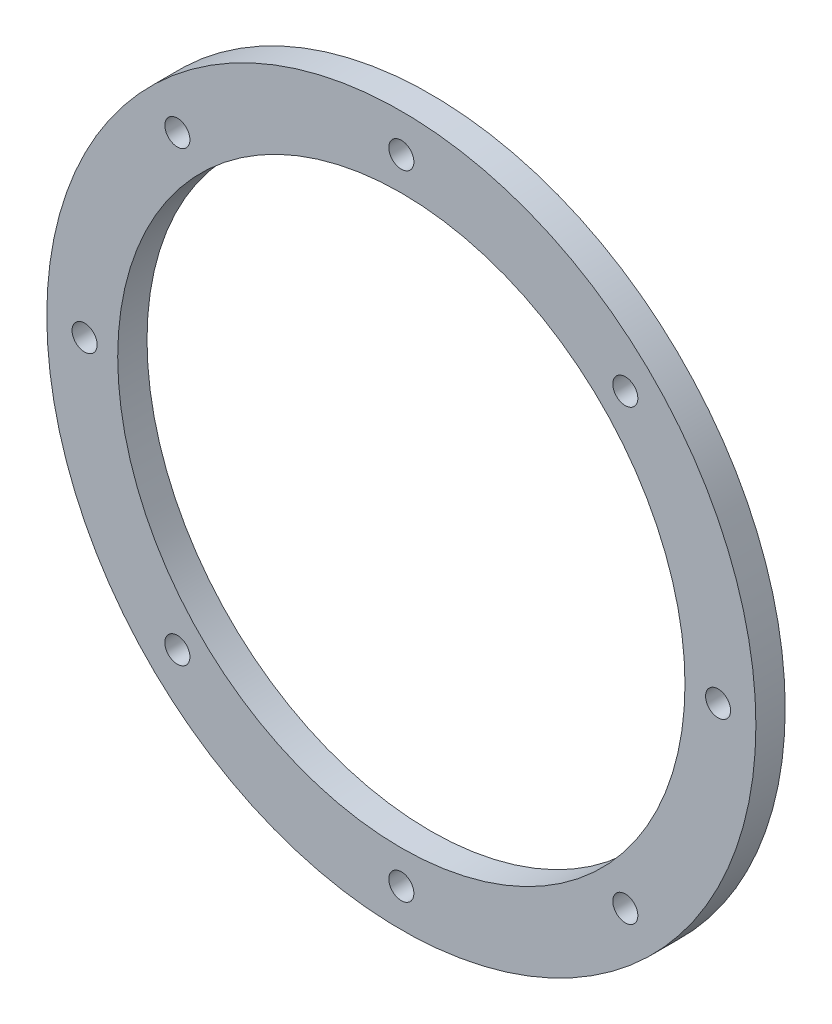
ISO-10303-21;
HEADER;
FILE_DESCRIPTION(('STEP AP214'),'2;1');
FILE_NAME('part.step','',(''),(''),'','','');
FILE_SCHEMA(('AUTOMOTIVE_DESIGN { 1 0 10303 214 1 1 1 1 }'));
ENDSEC;
DATA;
#1=APPLICATION_CONTEXT('core data for automotive mechanical design processes');
#2=APPLICATION_PROTOCOL_DEFINITION('international standard','automotive_design',2000,#1);
#3=PRODUCT_CONTEXT('',#1,'mechanical');
#4=PRODUCT('Part','Part','',(#3));
#5=PRODUCT_RELATED_PRODUCT_CATEGORY('part','',(#4));
#6=PRODUCT_DEFINITION_FORMATION('','',#4);
#7=PRODUCT_DEFINITION_CONTEXT('part definition',#1,'design');
#8=PRODUCT_DEFINITION('design','',#6,#7);
#9=PRODUCT_DEFINITION_SHAPE('','',#8);
#10=(LENGTH_UNIT() NAMED_UNIT(*) SI_UNIT(.MILLI.,.METRE.));
#11=(NAMED_UNIT(*) PLANE_ANGLE_UNIT() SI_UNIT($,.RADIAN.));
#12=(NAMED_UNIT(*) SI_UNIT($,.STERADIAN.) SOLID_ANGLE_UNIT());
#13=UNCERTAINTY_MEASURE_WITH_UNIT(LENGTH_MEASURE(1.E-05),#10,'distance_accuracy_value','');
#14=(GEOMETRIC_REPRESENTATION_CONTEXT(3) GLOBAL_UNCERTAINTY_ASSIGNED_CONTEXT((#13)) GLOBAL_UNIT_ASSIGNED_CONTEXT((#10,
#11,#12)) REPRESENTATION_CONTEXT('',''));
#15=CARTESIAN_POINT('',(0.,0.,0.));
#16=DIRECTION('',(0.,0.,1.));
#17=DIRECTION('',(1.,0.,0.));
#18=AXIS2_PLACEMENT_3D('',#15,#16,#17);
#19=CARTESIAN_POINT('',(0.,0.,7.874));
#20=DIRECTION('',(0.,0.,1.));
#21=DIRECTION('',(1.,0.,0.));
#22=AXIS2_PLACEMENT_3D('',#19,#20,#21);
#23=PLANE('',#22);
#24=CARTESIAN_POINT('',(-85.09,-2.97090147122162E-13,7.874));
#25=DIRECTION('',(0.,0.,1.));
#26=DIRECTION('',(0.,1.,0.));
#27=AXIS2_PLACEMENT_3D('',#24,#25,#26);
#28=CIRCLE('',#27,3.3655);
#29=CARTESIAN_POINT('',(-85.09,3.3654999999997,7.874));
#30=VERTEX_POINT('',#29);
#31=EDGE_CURVE('E105',#30,#30,#28,.T.);
#32=ORIENTED_EDGE('',*,*,#31,.F.);
#33=EDGE_LOOP('',(#32));
#34=FACE_BOUND('',#33,.T.);
#35=CARTESIAN_POINT('',(-60.167716011163,-60.1677160111636,7.874));
#36=DIRECTION('',(0.,0.,1.));
#37=DIRECTION('',(-0.707106781186551,0.707106781186544,0.));
#38=AXIS2_PLACEMENT_3D('',#35,#36,#37);
#39=CIRCLE('',#38,3.3655);
#40=CARTESIAN_POINT('',(-62.5474838832464,-57.7879481390803,7.874));
#41=VERTEX_POINT('',#40);
#42=EDGE_CURVE('E97',#41,#41,#39,.T.);
#43=ORIENTED_EDGE('',*,*,#42,.F.);
#44=EDGE_LOOP('',(#43));
#45=FACE_BOUND('',#44,.T.);
#46=CARTESIAN_POINT('',(0.,-85.09,7.874));
#47=DIRECTION('',(0.,0.,1.));
#48=DIRECTION('',(-1.,0.,0.));
#49=AXIS2_PLACEMENT_3D('',#46,#47,#48);
#50=CIRCLE('',#49,3.3655);
#51=CARTESIAN_POINT('',(-3.3655,-85.09,7.874));
#52=VERTEX_POINT('',#51);
#53=EDGE_CURVE('E89',#52,#52,#50,.T.);
#54=ORIENTED_EDGE('',*,*,#53,.F.);
#55=EDGE_LOOP('',(#54));
#56=FACE_BOUND('',#55,.T.);
#57=CARTESIAN_POINT('',(60.1677160111638,-60.1677160111628,7.874));
#58=DIRECTION('',(0.,0.,1.));
#59=DIRECTION('',(-0.707106781186541,-0.707106781186554,0.));
#60=AXIS2_PLACEMENT_3D('',#57,#58,#59);
#61=CIRCLE('',#60,3.3655);
#62=CARTESIAN_POINT('',(57.7879481390805,-62.5474838832461,7.874));
#63=VERTEX_POINT('',#62);
#64=EDGE_CURVE('E80',#63,#63,#61,.T.);
#65=ORIENTED_EDGE('',*,*,#64,.F.);
#66=EDGE_LOOP('',(#65));
#67=FACE_BOUND('',#66,.T.);
#68=CARTESIAN_POINT('',(85.09,8.91270441366487E-13,7.874));
#69=DIRECTION('',(0.,0.,1.));
#70=DIRECTION('',(0.,-1.,0.));
#71=AXIS2_PLACEMENT_3D('',#68,#69,#70);
#72=CIRCLE('',#71,3.3655);
#73=CARTESIAN_POINT('',(85.09,-3.36549999999911,7.874));
#74=VERTEX_POINT('',#73);
#75=EDGE_CURVE('E120',#74,#74,#72,.T.);
#76=ORIENTED_EDGE('',*,*,#75,.F.);
#77=EDGE_LOOP('',(#76));
#78=FACE_BOUND('',#77,.T.);
#79=CARTESIAN_POINT('',(60.1677160111626,60.1677160111641,7.874));
#80=DIRECTION('',(0.,0.,1.));
#81=DIRECTION('',(0.707106781186556,-0.707106781186539,0.));
#82=AXIS2_PLACEMENT_3D('',#79,#80,#81);
#83=CIRCLE('',#82,3.3655);
#84=CARTESIAN_POINT('',(62.547483883246,57.7879481390808,7.874));
#85=VERTEX_POINT('',#84);
#86=EDGE_CURVE('E112',#85,#85,#83,.T.);
#87=ORIENTED_EDGE('',*,*,#86,.F.);
#88=EDGE_LOOP('',(#87));
#89=FACE_BOUND('',#88,.T.);
#90=CARTESIAN_POINT('',(-60.1677160111634,60.1677160111632,7.874));
#91=DIRECTION('',(0.,0.,1.));
#92=DIRECTION('',(0.707106781186546,0.707106781186549,0.));
#93=AXIS2_PLACEMENT_3D('',#90,#91,#92);
#94=CIRCLE('',#93,3.3655);
#95=CARTESIAN_POINT('',(-57.7879481390801,62.5474838832466,7.874));
#96=VERTEX_POINT('',#95);
#97=EDGE_CURVE('E72',#96,#96,#94,.T.);
#98=ORIENTED_EDGE('',*,*,#97,.F.);
#99=EDGE_LOOP('',(#98));
#100=FACE_BOUND('',#99,.T.);
#101=CARTESIAN_POINT('',(0.,85.09,7.874));
#102=DIRECTION('',(0.,0.,1.));
#103=DIRECTION('',(1.,0.,0.));
#104=AXIS2_PLACEMENT_3D('',#101,#102,#103);
#105=CIRCLE('',#104,3.3655);
#106=CARTESIAN_POINT('',(3.3655,85.09,7.874));
#107=VERTEX_POINT('',#106);
#108=EDGE_CURVE('E64',#107,#107,#105,.T.);
#109=ORIENTED_EDGE('',*,*,#108,.F.);
#110=EDGE_LOOP('',(#109));
#111=FACE_BOUND('',#110,.T.);
#112=CARTESIAN_POINT('',(0.,0.,7.874));
#113=DIRECTION('',(0.,0.,1.));
#114=DIRECTION('',(1.,0.,0.));
#115=AXIS2_PLACEMENT_3D('',#112,#113,#114);
#116=CIRCLE('',#115,95.25);
#117=CARTESIAN_POINT('',(95.25,0.,7.874));
#118=VERTEX_POINT('',#117);
#119=EDGE_CURVE('E10',#118,#118,#116,.T.);
#120=ORIENTED_EDGE('',*,*,#119,.T.);
#121=EDGE_LOOP('',(#120));
#122=FACE_BOUND('',#121,.T.);
#123=CARTESIAN_POINT('',(0.,0.,7.874));
#124=DIRECTION('',(0.,0.,1.));
#125=DIRECTION('',(1.,0.,0.));
#126=AXIS2_PLACEMENT_3D('',#123,#124,#125);
#127=CIRCLE('',#126,76.2);
#128=CARTESIAN_POINT('',(76.2,0.,7.874));
#129=VERTEX_POINT('',#128);
#130=EDGE_CURVE('E54',#129,#129,#127,.T.);
#131=ORIENTED_EDGE('',*,*,#130,.F.);
#132=EDGE_LOOP('',(#131));
#133=FACE_BOUND('',#132,.T.);
#134=ADVANCED_FACE('F41',(#34,#45,#56,#67,#78,#89,#100,#111,#122,#133),#23,.T.);
#135=CARTESIAN_POINT('',(0.,0.,0.));
#136=DIRECTION('',(0.,0.,1.));
#137=DIRECTION('',(1.,0.,0.));
#138=AXIS2_PLACEMENT_3D('',#135,#136,#137);
#139=PLANE('',#138);
#140=CARTESIAN_POINT('',(-85.09,-2.97090147122162E-13,0.));
#141=DIRECTION('',(0.,0.,1.));
#142=DIRECTION('',(0.,1.,0.));
#143=AXIS2_PLACEMENT_3D('',#140,#141,#142);
#144=CIRCLE('',#143,3.3655);
#145=CARTESIAN_POINT('',(-85.09,3.3654999999997,0.));
#146=VERTEX_POINT('',#145);
#147=EDGE_CURVE('E76',#146,#146,#144,.T.);
#148=ORIENTED_EDGE('',*,*,#147,.T.);
#149=EDGE_LOOP('',(#148));
#150=FACE_BOUND('',#149,.T.);
#151=CARTESIAN_POINT('',(-60.167716011163,-60.1677160111636,0.));
#152=DIRECTION('',(0.,0.,1.));
#153=DIRECTION('',(-0.707106781186551,0.707106781186544,0.));
#154=AXIS2_PLACEMENT_3D('',#151,#152,#153);
#155=CIRCLE('',#154,3.3655);
#156=CARTESIAN_POINT('',(-62.5474838832464,-57.7879481390803,0.));
#157=VERTEX_POINT('',#156);
#158=EDGE_CURVE('E101',#157,#157,#155,.T.);
#159=ORIENTED_EDGE('',*,*,#158,.T.);
#160=EDGE_LOOP('',(#159));
#161=FACE_BOUND('',#160,.T.);
#162=CARTESIAN_POINT('',(0.,-85.09,0.));
#163=DIRECTION('',(0.,0.,1.));
#164=DIRECTION('',(-1.,0.,0.));
#165=AXIS2_PLACEMENT_3D('',#162,#163,#164);
#166=CIRCLE('',#165,3.3655);
#167=CARTESIAN_POINT('',(-3.3655,-85.09,0.));
#168=VERTEX_POINT('',#167);
#169=EDGE_CURVE('E93',#168,#168,#166,.T.);
#170=ORIENTED_EDGE('',*,*,#169,.T.);
#171=EDGE_LOOP('',(#170));
#172=FACE_BOUND('',#171,.T.);
#173=CARTESIAN_POINT('',(60.1677160111638,-60.1677160111628,0.));
#174=DIRECTION('',(0.,0.,1.));
#175=DIRECTION('',(-0.707106781186541,-0.707106781186554,0.));
#176=AXIS2_PLACEMENT_3D('',#173,#174,#175);
#177=CIRCLE('',#176,3.3655);
#178=CARTESIAN_POINT('',(57.7879481390805,-62.5474838832461,0.));
#179=VERTEX_POINT('',#178);
#180=EDGE_CURVE('E84',#179,#179,#177,.T.);
#181=ORIENTED_EDGE('',*,*,#180,.T.);
#182=EDGE_LOOP('',(#181));
#183=FACE_BOUND('',#182,.T.);
#184=CARTESIAN_POINT('',(85.09,8.91270441366487E-13,0.));
#185=DIRECTION('',(0.,0.,1.));
#186=DIRECTION('',(0.,-1.,0.));
#187=AXIS2_PLACEMENT_3D('',#184,#185,#186);
#188=CIRCLE('',#187,3.3655);
#189=CARTESIAN_POINT('',(85.09,-3.36549999999911,0.));
#190=VERTEX_POINT('',#189);
#191=EDGE_CURVE('E85',#190,#190,#188,.T.);
#192=ORIENTED_EDGE('',*,*,#191,.T.);
#193=EDGE_LOOP('',(#192));
#194=FACE_BOUND('',#193,.T.);
#195=CARTESIAN_POINT('',(60.1677160111626,60.1677160111641,0.));
#196=DIRECTION('',(0.,0.,1.));
#197=DIRECTION('',(0.707106781186556,-0.707106781186539,0.));
#198=AXIS2_PLACEMENT_3D('',#195,#196,#197);
#199=CIRCLE('',#198,3.3655);
#200=CARTESIAN_POINT('',(62.547483883246,57.7879481390808,0.));
#201=VERTEX_POINT('',#200);
#202=EDGE_CURVE('E116',#201,#201,#199,.T.);
#203=ORIENTED_EDGE('',*,*,#202,.T.);
#204=EDGE_LOOP('',(#203));
#205=FACE_BOUND('',#204,.T.);
#206=CARTESIAN_POINT('',(-60.1677160111634,60.1677160111632,0.));
#207=DIRECTION('',(0.,0.,1.));
#208=DIRECTION('',(0.707106781186546,0.707106781186549,0.));
#209=AXIS2_PLACEMENT_3D('',#206,#207,#208);
#210=CIRCLE('',#209,3.3655);
#211=CARTESIAN_POINT('',(-57.7879481390801,62.5474838832466,0.));
#212=VERTEX_POINT('',#211);
#213=EDGE_CURVE('E68',#212,#212,#210,.T.);
#214=ORIENTED_EDGE('',*,*,#213,.T.);
#215=EDGE_LOOP('',(#214));
#216=FACE_BOUND('',#215,.T.);
#217=CARTESIAN_POINT('',(0.,85.09,0.));
#218=DIRECTION('',(0.,0.,1.));
#219=DIRECTION('',(1.,0.,0.));
#220=AXIS2_PLACEMENT_3D('',#217,#218,#219);
#221=CIRCLE('',#220,3.3655);
#222=CARTESIAN_POINT('',(3.3655,85.09,0.));
#223=VERTEX_POINT('',#222);
#224=EDGE_CURVE('E60',#223,#223,#221,.T.);
#225=ORIENTED_EDGE('',*,*,#224,.T.);
#226=EDGE_LOOP('',(#225));
#227=FACE_BOUND('',#226,.T.);
#228=CARTESIAN_POINT('',(0.,0.,0.));
#229=DIRECTION('',(0.,0.,1.));
#230=DIRECTION('',(1.,0.,0.));
#231=AXIS2_PLACEMENT_3D('',#228,#229,#230);
#232=CIRCLE('',#231,95.25);
#233=CARTESIAN_POINT('',(95.25,0.,0.));
#234=VERTEX_POINT('',#233);
#235=EDGE_CURVE('E45',#234,#234,#232,.T.);
#236=ORIENTED_EDGE('',*,*,#235,.F.);
#237=EDGE_LOOP('',(#236));
#238=FACE_BOUND('',#237,.T.);
#239=CARTESIAN_POINT('',(0.,0.,0.));
#240=DIRECTION('',(0.,0.,1.));
#241=DIRECTION('',(1.,0.,0.));
#242=AXIS2_PLACEMENT_3D('',#239,#240,#241);
#243=CIRCLE('',#242,76.2);
#244=CARTESIAN_POINT('',(76.2,0.,0.));
#245=VERTEX_POINT('',#244);
#246=EDGE_CURVE('E56',#245,#245,#243,.T.);
#247=ORIENTED_EDGE('',*,*,#246,.T.);
#248=EDGE_LOOP('',(#247));
#249=FACE_BOUND('',#248,.T.);
#250=ADVANCED_FACE('F128',(#150,#161,#172,#183,#194,#205,#216,#227,#238,#249),#139,.F.);
#251=CARTESIAN_POINT('',(0.,0.,7.874));
#252=DIRECTION('',(0.,0.,-1.));
#253=DIRECTION('',(-1.,0.,0.));
#254=AXIS2_PLACEMENT_3D('',#251,#252,#253);
#255=CYLINDRICAL_SURFACE('',#254,95.25);
#256=ORIENTED_EDGE('',*,*,#119,.F.);
#257=EDGE_LOOP('',(#256));
#258=FACE_BOUND('',#257,.T.);
#259=ORIENTED_EDGE('',*,*,#235,.T.);
#260=EDGE_LOOP('',(#259));
#261=FACE_BOUND('',#260,.T.);
#262=ADVANCED_FACE('F43',(#258,#261),#255,.T.);
#263=CARTESIAN_POINT('',(0.,0.,7.874));
#264=DIRECTION('',(0.,0.,-1.));
#265=DIRECTION('',(-1.,0.,0.));
#266=AXIS2_PLACEMENT_3D('',#263,#264,#265);
#267=CYLINDRICAL_SURFACE('',#266,76.2);
#268=ORIENTED_EDGE('',*,*,#130,.T.);
#269=EDGE_LOOP('',(#268));
#270=FACE_BOUND('',#269,.T.);
#271=ORIENTED_EDGE('',*,*,#246,.F.);
#272=EDGE_LOOP('',(#271));
#273=FACE_BOUND('',#272,.T.);
#274=ADVANCED_FACE('F151',(#270,#273),#267,.F.);
#275=CARTESIAN_POINT('',(0.,85.09,0.));
#276=DIRECTION('',(0.,0.,1.));
#277=DIRECTION('',(1.,0.,0.));
#278=AXIS2_PLACEMENT_3D('',#275,#276,#277);
#279=CYLINDRICAL_SURFACE('',#278,3.3655);
#280=ORIENTED_EDGE('',*,*,#224,.F.);
#281=EDGE_LOOP('',(#280));
#282=FACE_BOUND('',#281,.T.);
#283=ORIENTED_EDGE('',*,*,#108,.T.);
#284=EDGE_LOOP('',(#283));
#285=FACE_BOUND('',#284,.T.);
#286=ADVANCED_FACE('F154',(#282,#285),#279,.F.);
#287=CARTESIAN_POINT('',(-60.1677160111634,60.1677160111632,0.));
#288=DIRECTION('',(0.,0.,1.));
#289=DIRECTION('',(1.,0.,0.));
#290=AXIS2_PLACEMENT_3D('',#287,#288,#289);
#291=CYLINDRICAL_SURFACE('',#290,3.3655);
#292=ORIENTED_EDGE('',*,*,#213,.F.);
#293=EDGE_LOOP('',(#292));
#294=FACE_BOUND('',#293,.T.);
#295=ORIENTED_EDGE('',*,*,#97,.T.);
#296=EDGE_LOOP('',(#295));
#297=FACE_BOUND('',#296,.T.);
#298=ADVANCED_FACE('F168',(#294,#297),#291,.F.);
#299=CARTESIAN_POINT('',(60.1677160111626,60.1677160111641,0.));
#300=DIRECTION('',(0.,0.,1.));
#301=DIRECTION('',(1.,0.,0.));
#302=AXIS2_PLACEMENT_3D('',#299,#300,#301);
#303=CYLINDRICAL_SURFACE('',#302,3.3655);
#304=ORIENTED_EDGE('',*,*,#202,.F.);
#305=EDGE_LOOP('',(#304));
#306=FACE_BOUND('',#305,.T.);
#307=ORIENTED_EDGE('',*,*,#86,.T.);
#308=EDGE_LOOP('',(#307));
#309=FACE_BOUND('',#308,.T.);
#310=ADVANCED_FACE('F135',(#306,#309),#303,.F.);
#311=CARTESIAN_POINT('',(85.09,8.91270441366487E-13,0.));
#312=DIRECTION('',(0.,0.,1.));
#313=DIRECTION('',(1.,0.,0.));
#314=AXIS2_PLACEMENT_3D('',#311,#312,#313);
#315=CYLINDRICAL_SURFACE('',#314,3.3655);
#316=ORIENTED_EDGE('',*,*,#191,.F.);
#317=EDGE_LOOP('',(#316));
#318=FACE_BOUND('',#317,.T.);
#319=ORIENTED_EDGE('',*,*,#75,.T.);
#320=EDGE_LOOP('',(#319));
#321=FACE_BOUND('',#320,.T.);
#322=ADVANCED_FACE('F131',(#318,#321),#315,.F.);
#323=CARTESIAN_POINT('',(60.1677160111638,-60.1677160111628,0.));
#324=DIRECTION('',(0.,0.,1.));
#325=DIRECTION('',(1.,0.,0.));
#326=AXIS2_PLACEMENT_3D('',#323,#324,#325);
#327=CYLINDRICAL_SURFACE('',#326,3.3655);
#328=ORIENTED_EDGE('',*,*,#180,.F.);
#329=EDGE_LOOP('',(#328));
#330=FACE_BOUND('',#329,.T.);
#331=ORIENTED_EDGE('',*,*,#64,.T.);
#332=EDGE_LOOP('',(#331));
#333=FACE_BOUND('',#332,.T.);
#334=ADVANCED_FACE('F134',(#330,#333),#327,.F.);
#335=CARTESIAN_POINT('',(0.,-85.09,0.));
#336=DIRECTION('',(0.,0.,1.));
#337=DIRECTION('',(1.,0.,0.));
#338=AXIS2_PLACEMENT_3D('',#335,#336,#337);
#339=CYLINDRICAL_SURFACE('',#338,3.3655);
#340=ORIENTED_EDGE('',*,*,#169,.F.);
#341=EDGE_LOOP('',(#340));
#342=FACE_BOUND('',#341,.T.);
#343=ORIENTED_EDGE('',*,*,#53,.T.);
#344=EDGE_LOOP('',(#343));
#345=FACE_BOUND('',#344,.T.);
#346=ADVANCED_FACE('F175',(#342,#345),#339,.F.);
#347=CARTESIAN_POINT('',(-60.167716011163,-60.1677160111636,0.));
#348=DIRECTION('',(0.,0.,1.));
#349=DIRECTION('',(1.,0.,0.));
#350=AXIS2_PLACEMENT_3D('',#347,#348,#349);
#351=CYLINDRICAL_SURFACE('',#350,3.3655);
#352=ORIENTED_EDGE('',*,*,#158,.F.);
#353=EDGE_LOOP('',(#352));
#354=FACE_BOUND('',#353,.T.);
#355=ORIENTED_EDGE('',*,*,#42,.T.);
#356=EDGE_LOOP('',(#355));
#357=FACE_BOUND('',#356,.T.);
#358=ADVANCED_FACE('F179',(#354,#357),#351,.F.);
#359=CARTESIAN_POINT('',(-85.09,-2.97090147122162E-13,0.));
#360=DIRECTION('',(0.,0.,1.));
#361=DIRECTION('',(1.,0.,0.));
#362=AXIS2_PLACEMENT_3D('',#359,#360,#361);
#363=CYLINDRICAL_SURFACE('',#362,3.3655);
#364=ORIENTED_EDGE('',*,*,#147,.F.);
#365=EDGE_LOOP('',(#364));
#366=FACE_BOUND('',#365,.T.);
#367=ORIENTED_EDGE('',*,*,#31,.T.);
#368=EDGE_LOOP('',(#367));
#369=FACE_BOUND('',#368,.T.);
#370=ADVANCED_FACE('F183',(#366,#369),#363,.F.);
#371=CLOSED_SHELL('',(#134,#250,#262,#274,#286,#298,#310,#322,#334,#346,#358,#370));
#372=MANIFOLD_SOLID_BREP('B2',#371);
#373=ADVANCED_BREP_SHAPE_REPRESENTATION('',(#18,#372),#14);
#374=SHAPE_DEFINITION_REPRESENTATION(#9,#373);
ENDSEC;
END-ISO-10303-21;
